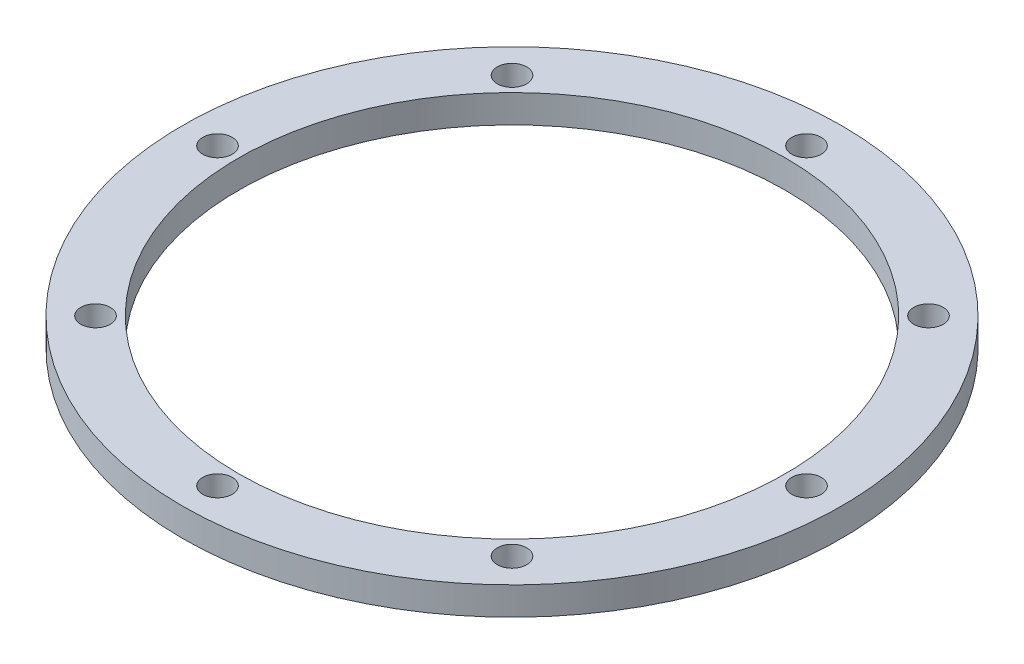
ISO-10303-21;
HEADER;
FILE_DESCRIPTION(('STEP AP214'),'2;1');
FILE_NAME('part.step','',(''),(''),'','','');
FILE_SCHEMA(('AUTOMOTIVE_DESIGN { 1 0 10303 214 1 1 1 1 }'));
ENDSEC;
DATA;
#1=APPLICATION_CONTEXT('core data for automotive mechanical design processes');
#2=APPLICATION_PROTOCOL_DEFINITION('international standard','automotive_design',2000,#1);
#3=PRODUCT_CONTEXT('',#1,'mechanical');
#4=PRODUCT('Part','Part','',(#3));
#5=PRODUCT_RELATED_PRODUCT_CATEGORY('part','',(#4));
#6=PRODUCT_DEFINITION_FORMATION('','',#4);
#7=PRODUCT_DEFINITION_CONTEXT('part definition',#1,'design');
#8=PRODUCT_DEFINITION('design','',#6,#7);
#9=PRODUCT_DEFINITION_SHAPE('','',#8);
#10=(LENGTH_UNIT() NAMED_UNIT(*) SI_UNIT(.MILLI.,.METRE.));
#11=(NAMED_UNIT(*) PLANE_ANGLE_UNIT() SI_UNIT($,.RADIAN.));
#12=(NAMED_UNIT(*) SI_UNIT($,.STERADIAN.) SOLID_ANGLE_UNIT());
#13=UNCERTAINTY_MEASURE_WITH_UNIT(LENGTH_MEASURE(1.E-05),#10,'distance_accuracy_value','');
#14=(GEOMETRIC_REPRESENTATION_CONTEXT(3) GLOBAL_UNCERTAINTY_ASSIGNED_CONTEXT((#13)) GLOBAL_UNIT_ASSIGNED_CONTEXT((#10,
#11,#12)) REPRESENTATION_CONTEXT('',''));
#15=CARTESIAN_POINT('',(0.,0.,0.));
#16=DIRECTION('',(0.,0.,1.));
#17=DIRECTION('',(1.,0.,0.));
#18=AXIS2_PLACEMENT_3D('',#15,#16,#17);
#19=CARTESIAN_POINT('',(0.,0.,0.));
#20=DIRECTION('',(0.,-1.,0.));
#21=DIRECTION('',(0.,0.,-1.));
#22=AXIS2_PLACEMENT_3D('',#19,#20,#21);
#23=CYLINDRICAL_SURFACE('',#22,39.);
#24=CARTESIAN_POINT('',(0.,4.,0.));
#25=DIRECTION('',(0.,-1.,0.));
#26=DIRECTION('',(0.,0.,-1.));
#27=AXIS2_PLACEMENT_3D('',#24,#25,#26);
#28=CIRCLE('',#27,39.);
#29=CARTESIAN_POINT('',(0.,4.,-39.));
#30=VERTEX_POINT('',#29);
#31=EDGE_CURVE('E71',#30,#30,#28,.T.);
#32=ORIENTED_EDGE('',*,*,#31,.F.);
#33=EDGE_LOOP('',(#32));
#34=FACE_BOUND('',#33,.T.);
#35=CARTESIAN_POINT('',(0.,0.,0.));
#36=DIRECTION('',(0.,-1.,0.));
#37=DIRECTION('',(0.,0.,-1.));
#38=AXIS2_PLACEMENT_3D('',#35,#36,#37);
#39=CIRCLE('',#38,39.);
#40=CARTESIAN_POINT('',(0.,0.,-39.));
#41=VERTEX_POINT('',#40);
#42=EDGE_CURVE('E10',#41,#41,#39,.T.);
#43=ORIENTED_EDGE('',*,*,#42,.T.);
#44=EDGE_LOOP('',(#43));
#45=FACE_BOUND('',#44,.T.);
#46=ADVANCED_FACE('F32',(#34,#45),#23,.F.);
#47=CARTESIAN_POINT('',(-39.,0.,0.));
#48=DIRECTION('',(0.,1.,0.));
#49=DIRECTION('',(0.,0.,1.));
#50=AXIS2_PLACEMENT_3D('',#47,#48,#49);
#51=PLANE('',#50);
#52=CARTESIAN_POINT('',(0.,0.,42.));
#53=DIRECTION('',(0.,-1.,0.));
#54=DIRECTION('',(0.,0.,-1.));
#55=AXIS2_PLACEMENT_3D('',#52,#53,#54);
#56=CIRCLE('',#55,2.1);
#57=CARTESIAN_POINT('',(0.,0.,39.9));
#58=VERTEX_POINT('',#57);
#59=EDGE_CURVE('E52',#58,#58,#56,.T.);
#60=ORIENTED_EDGE('',*,*,#59,.F.);
#61=EDGE_LOOP('',(#60));
#62=FACE_BOUND('',#61,.T.);
#63=CARTESIAN_POINT('',(29.698484809835,0.,29.698484809835));
#64=DIRECTION('',(0.,-1.,0.));
#65=DIRECTION('',(0.,0.,-1.));
#66=AXIS2_PLACEMENT_3D('',#63,#64,#65);
#67=CIRCLE('',#66,2.10000000000006);
#68=CARTESIAN_POINT('',(29.698484809835,0.,27.5984848098349));
#69=VERTEX_POINT('',#68);
#70=EDGE_CURVE('E98',#69,#69,#67,.T.);
#71=ORIENTED_EDGE('',*,*,#70,.F.);
#72=EDGE_LOOP('',(#71));
#73=FACE_BOUND('',#72,.T.);
#74=CARTESIAN_POINT('',(42.,0.,0.));
#75=DIRECTION('',(0.,-1.,0.));
#76=DIRECTION('',(0.,0.,-1.));
#77=AXIS2_PLACEMENT_3D('',#74,#75,#76);
#78=CIRCLE('',#77,2.10000000000014);
#79=CARTESIAN_POINT('',(42.,0.,-2.10000000000014));
#80=VERTEX_POINT('',#79);
#81=EDGE_CURVE('E95',#80,#80,#78,.T.);
#82=ORIENTED_EDGE('',*,*,#81,.F.);
#83=EDGE_LOOP('',(#82));
#84=FACE_BOUND('',#83,.T.);
#85=CARTESIAN_POINT('',(29.698484809835,0.,-29.698484809835));
#86=DIRECTION('',(0.,-1.,0.));
#87=DIRECTION('',(0.,0.,-1.));
#88=AXIS2_PLACEMENT_3D('',#85,#86,#87);
#89=CIRCLE('',#88,2.10000000000022);
#90=CARTESIAN_POINT('',(29.698484809835,0.,-31.7984848098352));
#91=VERTEX_POINT('',#90);
#92=EDGE_CURVE('E92',#91,#91,#89,.T.);
#93=ORIENTED_EDGE('',*,*,#92,.F.);
#94=EDGE_LOOP('',(#93));
#95=FACE_BOUND('',#94,.T.);
#96=CARTESIAN_POINT('',(0.,0.,-42.));
#97=DIRECTION('',(0.,-1.,0.));
#98=DIRECTION('',(0.,0.,-1.));
#99=AXIS2_PLACEMENT_3D('',#96,#97,#98);
#100=CIRCLE('',#99,2.10000000000028);
#101=CARTESIAN_POINT('',(0.,0.,-44.1000000000003));
#102=VERTEX_POINT('',#101);
#103=EDGE_CURVE('E89',#102,#102,#100,.T.);
#104=ORIENTED_EDGE('',*,*,#103,.F.);
#105=EDGE_LOOP('',(#104));
#106=FACE_BOUND('',#105,.T.);
#107=CARTESIAN_POINT('',(-29.698484809835,0.,-29.698484809835));
#108=DIRECTION('',(0.,-1.,0.));
#109=DIRECTION('',(0.,0.,-1.));
#110=AXIS2_PLACEMENT_3D('',#107,#108,#109);
#111=CIRCLE('',#110,2.10000000000037);
#112=CARTESIAN_POINT('',(-29.698484809835,0.,-31.7984848098354));
#113=VERTEX_POINT('',#112);
#114=EDGE_CURVE('E86',#113,#113,#111,.T.);
#115=ORIENTED_EDGE('',*,*,#114,.F.);
#116=EDGE_LOOP('',(#115));
#117=FACE_BOUND('',#116,.T.);
#118=CARTESIAN_POINT('',(-42.,0.,0.));
#119=DIRECTION('',(0.,-1.,0.));
#120=DIRECTION('',(0.,0.,-1.));
#121=AXIS2_PLACEMENT_3D('',#118,#119,#120);
#122=CIRCLE('',#121,2.10000000000043);
#123=CARTESIAN_POINT('',(-42.,0.,-2.10000000000043));
#124=VERTEX_POINT('',#123);
#125=EDGE_CURVE('E83',#124,#124,#122,.T.);
#126=ORIENTED_EDGE('',*,*,#125,.F.);
#127=EDGE_LOOP('',(#126));
#128=FACE_BOUND('',#127,.T.);
#129=CARTESIAN_POINT('',(-29.698484809835,0.,29.698484809835));
#130=DIRECTION('',(0.,-1.,0.));
#131=DIRECTION('',(0.,0.,-1.));
#132=AXIS2_PLACEMENT_3D('',#129,#130,#131);
#133=CIRCLE('',#132,2.1000000000005);
#134=CARTESIAN_POINT('',(-29.698484809835,0.,27.5984848098345));
#135=VERTEX_POINT('',#134);
#136=EDGE_CURVE('E80',#135,#135,#133,.T.);
#137=ORIENTED_EDGE('',*,*,#136,.F.);
#138=EDGE_LOOP('',(#137));
#139=FACE_BOUND('',#138,.T.);
#140=ORIENTED_EDGE('',*,*,#42,.F.);
#141=EDGE_LOOP('',(#140));
#142=FACE_BOUND('',#141,.T.);
#143=CARTESIAN_POINT('',(0.,0.,0.));
#144=DIRECTION('',(0.,-1.,0.));
#145=DIRECTION('',(0.,0.,-1.));
#146=AXIS2_PLACEMENT_3D('',#143,#144,#145);
#147=CIRCLE('',#146,47.);
#148=CARTESIAN_POINT('',(0.,0.,-47.));
#149=VERTEX_POINT('',#148);
#150=EDGE_CURVE('E39',#149,#149,#147,.T.);
#151=ORIENTED_EDGE('',*,*,#150,.T.);
#152=EDGE_LOOP('',(#151));
#153=FACE_BOUND('',#152,.T.);
#154=ADVANCED_FACE('F107',(#62,#73,#84,#95,#106,#117,#128,#139,#142,#153),#51,.F.);
#155=CARTESIAN_POINT('',(0.,0.,0.));
#156=DIRECTION('',(0.,-1.,0.));
#157=DIRECTION('',(0.,0.,-1.));
#158=AXIS2_PLACEMENT_3D('',#155,#156,#157);
#159=CYLINDRICAL_SURFACE('',#158,47.);
#160=ORIENTED_EDGE('',*,*,#150,.F.);
#161=EDGE_LOOP('',(#160));
#162=FACE_BOUND('',#161,.T.);
#163=CARTESIAN_POINT('',(0.,4.,0.));
#164=DIRECTION('',(0.,-1.,0.));
#165=DIRECTION('',(0.,0.,-1.));
#166=AXIS2_PLACEMENT_3D('',#163,#164,#165);
#167=CIRCLE('',#166,47.);
#168=CARTESIAN_POINT('',(0.,4.,-47.));
#169=VERTEX_POINT('',#168);
#170=EDGE_CURVE('E44',#169,#169,#167,.T.);
#171=ORIENTED_EDGE('',*,*,#170,.T.);
#172=EDGE_LOOP('',(#171));
#173=FACE_BOUND('',#172,.T.);
#174=ADVANCED_FACE('F110',(#162,#173),#159,.T.);
#175=CARTESIAN_POINT('',(-47.,4.,0.));
#176=DIRECTION('',(0.,-1.,0.));
#177=DIRECTION('',(0.,0.,-1.));
#178=AXIS2_PLACEMENT_3D('',#175,#176,#177);
#179=PLANE('',#178);
#180=CARTESIAN_POINT('',(0.,4.,42.));
#181=DIRECTION('',(0.,-1.,0.));
#182=DIRECTION('',(0.,0.,-1.));
#183=AXIS2_PLACEMENT_3D('',#180,#181,#182);
#184=CIRCLE('',#183,2.1);
#185=CARTESIAN_POINT('',(0.,4.,39.9));
#186=VERTEX_POINT('',#185);
#187=EDGE_CURVE('E35',#186,#186,#184,.T.);
#188=ORIENTED_EDGE('',*,*,#187,.T.);
#189=EDGE_LOOP('',(#188));
#190=FACE_BOUND('',#189,.T.);
#191=CARTESIAN_POINT('',(29.698484809835,4.,29.698484809835));
#192=DIRECTION('',(0.,-1.,0.));
#193=DIRECTION('',(0.,0.,-1.));
#194=AXIS2_PLACEMENT_3D('',#191,#192,#193);
#195=CIRCLE('',#194,2.10000000000006);
#196=CARTESIAN_POINT('',(29.698484809835,4.,27.5984848098349));
#197=VERTEX_POINT('',#196);
#198=EDGE_CURVE('E66',#197,#197,#195,.T.);
#199=ORIENTED_EDGE('',*,*,#198,.T.);
#200=EDGE_LOOP('',(#199));
#201=FACE_BOUND('',#200,.T.);
#202=CARTESIAN_POINT('',(42.,4.,0.));
#203=DIRECTION('',(0.,-1.,0.));
#204=DIRECTION('',(0.,0.,-1.));
#205=AXIS2_PLACEMENT_3D('',#202,#203,#204);
#206=CIRCLE('',#205,2.10000000000014);
#207=CARTESIAN_POINT('',(42.,4.,-2.10000000000014));
#208=VERTEX_POINT('',#207);
#209=EDGE_CURVE('E64',#208,#208,#206,.T.);
#210=ORIENTED_EDGE('',*,*,#209,.T.);
#211=EDGE_LOOP('',(#210));
#212=FACE_BOUND('',#211,.T.);
#213=CARTESIAN_POINT('',(29.698484809835,4.,-29.698484809835));
#214=DIRECTION('',(0.,-1.,0.));
#215=DIRECTION('',(0.,0.,-1.));
#216=AXIS2_PLACEMENT_3D('',#213,#214,#215);
#217=CIRCLE('',#216,2.10000000000022);
#218=CARTESIAN_POINT('',(29.698484809835,4.,-31.7984848098352));
#219=VERTEX_POINT('',#218);
#220=EDGE_CURVE('E61',#219,#219,#217,.T.);
#221=ORIENTED_EDGE('',*,*,#220,.T.);
#222=EDGE_LOOP('',(#221));
#223=FACE_BOUND('',#222,.T.);
#224=CARTESIAN_POINT('',(0.,4.,-42.));
#225=DIRECTION('',(0.,-1.,0.));
#226=DIRECTION('',(0.,0.,-1.));
#227=AXIS2_PLACEMENT_3D('',#224,#225,#226);
#228=CIRCLE('',#227,2.10000000000028);
#229=CARTESIAN_POINT('',(0.,4.,-44.1000000000003));
#230=VERTEX_POINT('',#229);
#231=EDGE_CURVE('E58',#230,#230,#228,.T.);
#232=ORIENTED_EDGE('',*,*,#231,.T.);
#233=EDGE_LOOP('',(#232));
#234=FACE_BOUND('',#233,.T.);
#235=CARTESIAN_POINT('',(-29.698484809835,4.,-29.698484809835));
#236=DIRECTION('',(0.,-1.,0.));
#237=DIRECTION('',(0.,0.,-1.));
#238=AXIS2_PLACEMENT_3D('',#235,#236,#237);
#239=CIRCLE('',#238,2.10000000000037);
#240=CARTESIAN_POINT('',(-29.698484809835,4.,-31.7984848098354));
#241=VERTEX_POINT('',#240);
#242=EDGE_CURVE('E55',#241,#241,#239,.T.);
#243=ORIENTED_EDGE('',*,*,#242,.T.);
#244=EDGE_LOOP('',(#243));
#245=FACE_BOUND('',#244,.T.);
#246=CARTESIAN_POINT('',(-42.,4.,0.));
#247=DIRECTION('',(0.,-1.,0.));
#248=DIRECTION('',(0.,0.,-1.));
#249=AXIS2_PLACEMENT_3D('',#246,#247,#248);
#250=CIRCLE('',#249,2.10000000000043);
#251=CARTESIAN_POINT('',(-42.,4.,-2.10000000000043));
#252=VERTEX_POINT('',#251);
#253=EDGE_CURVE('E51',#252,#252,#250,.T.);
#254=ORIENTED_EDGE('',*,*,#253,.T.);
#255=EDGE_LOOP('',(#254));
#256=FACE_BOUND('',#255,.T.);
#257=CARTESIAN_POINT('',(-29.698484809835,4.,29.698484809835));
#258=DIRECTION('',(0.,-1.,0.));
#259=DIRECTION('',(0.,0.,-1.));
#260=AXIS2_PLACEMENT_3D('',#257,#258,#259);
#261=CIRCLE('',#260,2.1000000000005);
#262=CARTESIAN_POINT('',(-29.698484809835,4.,27.5984848098345));
#263=VERTEX_POINT('',#262);
#264=EDGE_CURVE('E48',#263,#263,#261,.T.);
#265=ORIENTED_EDGE('',*,*,#264,.T.);
#266=EDGE_LOOP('',(#265));
#267=FACE_BOUND('',#266,.T.);
#268=ORIENTED_EDGE('',*,*,#170,.F.);
#269=EDGE_LOOP('',(#268));
#270=FACE_BOUND('',#269,.T.);
#271=ORIENTED_EDGE('',*,*,#31,.T.);
#272=EDGE_LOOP('',(#271));
#273=FACE_BOUND('',#272,.T.);
#274=ADVANCED_FACE('F130',(#190,#201,#212,#223,#234,#245,#256,#267,#270,#273),#179,.F.);
#275=CARTESIAN_POINT('',(-29.698484809835,10.,29.698484809835));
#276=DIRECTION('',(0.,-1.,0.));
#277=DIRECTION('',(0.,0.,-1.));
#278=AXIS2_PLACEMENT_3D('',#275,#276,#277);
#279=CYLINDRICAL_SURFACE('',#278,2.1000000000005);
#280=ORIENTED_EDGE('',*,*,#136,.T.);
#281=EDGE_LOOP('',(#280));
#282=FACE_BOUND('',#281,.T.);
#283=ORIENTED_EDGE('',*,*,#264,.F.);
#284=EDGE_LOOP('',(#283));
#285=FACE_BOUND('',#284,.T.);
#286=ADVANCED_FACE('F135',(#282,#285),#279,.F.);
#287=CARTESIAN_POINT('',(-42.,10.,0.));
#288=DIRECTION('',(0.,-1.,0.));
#289=DIRECTION('',(0.,0.,-1.));
#290=AXIS2_PLACEMENT_3D('',#287,#288,#289);
#291=CYLINDRICAL_SURFACE('',#290,2.10000000000043);
#292=ORIENTED_EDGE('',*,*,#125,.T.);
#293=EDGE_LOOP('',(#292));
#294=FACE_BOUND('',#293,.T.);
#295=ORIENTED_EDGE('',*,*,#253,.F.);
#296=EDGE_LOOP('',(#295));
#297=FACE_BOUND('',#296,.T.);
#298=ADVANCED_FACE('F140',(#294,#297),#291,.F.);
#299=CARTESIAN_POINT('',(-29.698484809835,10.,-29.698484809835));
#300=DIRECTION('',(0.,-1.,0.));
#301=DIRECTION('',(0.,0.,-1.));
#302=AXIS2_PLACEMENT_3D('',#299,#300,#301);
#303=CYLINDRICAL_SURFACE('',#302,2.10000000000037);
#304=ORIENTED_EDGE('',*,*,#114,.T.);
#305=EDGE_LOOP('',(#304));
#306=FACE_BOUND('',#305,.T.);
#307=ORIENTED_EDGE('',*,*,#242,.F.);
#308=EDGE_LOOP('',(#307));
#309=FACE_BOUND('',#308,.T.);
#310=ADVANCED_FACE('F176',(#306,#309),#303,.F.);
#311=CARTESIAN_POINT('',(0.,10.,-42.));
#312=DIRECTION('',(0.,-1.,0.));
#313=DIRECTION('',(0.,0.,-1.));
#314=AXIS2_PLACEMENT_3D('',#311,#312,#313);
#315=CYLINDRICAL_SURFACE('',#314,2.10000000000028);
#316=ORIENTED_EDGE('',*,*,#103,.T.);
#317=EDGE_LOOP('',(#316));
#318=FACE_BOUND('',#317,.T.);
#319=ORIENTED_EDGE('',*,*,#231,.F.);
#320=EDGE_LOOP('',(#319));
#321=FACE_BOUND('',#320,.T.);
#322=ADVANCED_FACE('F185',(#318,#321),#315,.F.);
#323=CARTESIAN_POINT('',(29.698484809835,10.,-29.698484809835));
#324=DIRECTION('',(0.,-1.,0.));
#325=DIRECTION('',(0.,0.,-1.));
#326=AXIS2_PLACEMENT_3D('',#323,#324,#325);
#327=CYLINDRICAL_SURFACE('',#326,2.10000000000022);
#328=ORIENTED_EDGE('',*,*,#92,.T.);
#329=EDGE_LOOP('',(#328));
#330=FACE_BOUND('',#329,.T.);
#331=ORIENTED_EDGE('',*,*,#220,.F.);
#332=EDGE_LOOP('',(#331));
#333=FACE_BOUND('',#332,.T.);
#334=ADVANCED_FACE('F194',(#330,#333),#327,.F.);
#335=CARTESIAN_POINT('',(42.,10.,0.));
#336=DIRECTION('',(0.,-1.,0.));
#337=DIRECTION('',(0.,0.,-1.));
#338=AXIS2_PLACEMENT_3D('',#335,#336,#337);
#339=CYLINDRICAL_SURFACE('',#338,2.10000000000014);
#340=ORIENTED_EDGE('',*,*,#81,.T.);
#341=EDGE_LOOP('',(#340));
#342=FACE_BOUND('',#341,.T.);
#343=ORIENTED_EDGE('',*,*,#209,.F.);
#344=EDGE_LOOP('',(#343));
#345=FACE_BOUND('',#344,.T.);
#346=ADVANCED_FACE('F203',(#342,#345),#339,.F.);
#347=CARTESIAN_POINT('',(29.698484809835,10.,29.698484809835));
#348=DIRECTION('',(0.,-1.,0.));
#349=DIRECTION('',(0.,0.,-1.));
#350=AXIS2_PLACEMENT_3D('',#347,#348,#349);
#351=CYLINDRICAL_SURFACE('',#350,2.10000000000006);
#352=ORIENTED_EDGE('',*,*,#70,.T.);
#353=EDGE_LOOP('',(#352));
#354=FACE_BOUND('',#353,.T.);
#355=ORIENTED_EDGE('',*,*,#198,.F.);
#356=EDGE_LOOP('',(#355));
#357=FACE_BOUND('',#356,.T.);
#358=ADVANCED_FACE('F212',(#354,#357),#351,.F.);
#359=CARTESIAN_POINT('',(0.,10.,42.));
#360=DIRECTION('',(0.,-1.,0.));
#361=DIRECTION('',(0.,0.,-1.));
#362=AXIS2_PLACEMENT_3D('',#359,#360,#361);
#363=CYLINDRICAL_SURFACE('',#362,2.1);
#364=ORIENTED_EDGE('',*,*,#59,.T.);
#365=EDGE_LOOP('',(#364));
#366=FACE_BOUND('',#365,.T.);
#367=ORIENTED_EDGE('',*,*,#187,.F.);
#368=EDGE_LOOP('',(#367));
#369=FACE_BOUND('',#368,.T.);
#370=ADVANCED_FACE('F104',(#366,#369),#363,.F.);
#371=CLOSED_SHELL('',(#46,#154,#174,#274,#286,#298,#310,#322,#334,#346,#358,#370));
#372=MANIFOLD_SOLID_BREP('B2',#371);
#373=ADVANCED_BREP_SHAPE_REPRESENTATION('',(#18,#372),#14);
#374=SHAPE_DEFINITION_REPRESENTATION(#9,#373);
ENDSEC;
END-ISO-10303-21;
